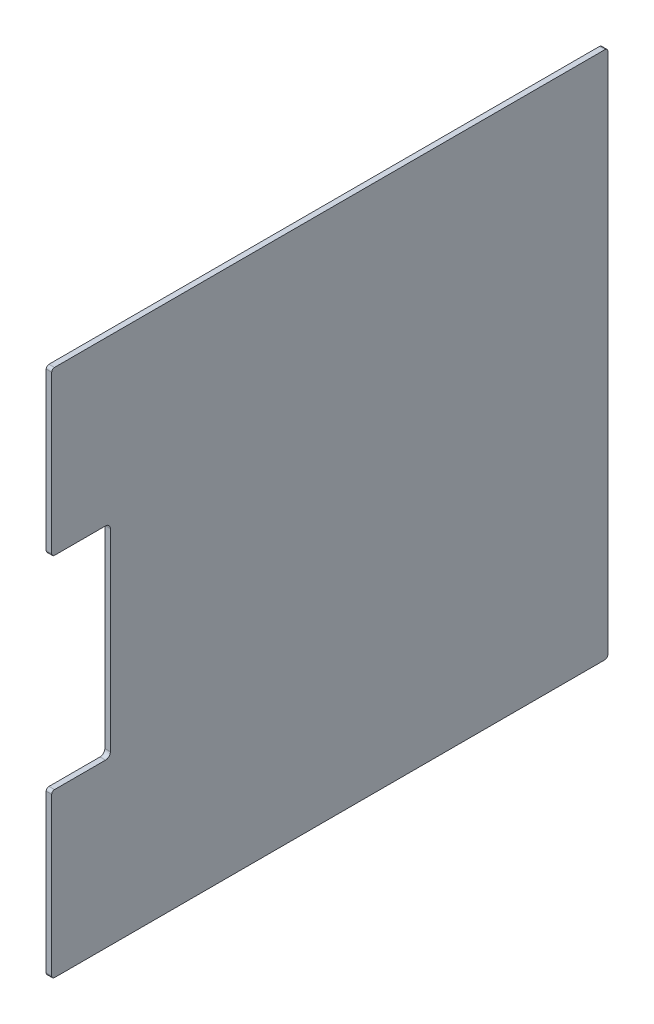
ISO-10303-21;
HEADER;
FILE_DESCRIPTION(('STEP AP214'),'2;1');
FILE_NAME('part.step','',(''),(''),'','','');
FILE_SCHEMA(('AUTOMOTIVE_DESIGN { 1 0 10303 214 1 1 1 1 }'));
ENDSEC;
DATA;
#1=APPLICATION_CONTEXT('core data for automotive mechanical design processes');
#2=APPLICATION_PROTOCOL_DEFINITION('international standard','automotive_design',2000,#1);
#3=PRODUCT_CONTEXT('',#1,'mechanical');
#4=PRODUCT('Part','Part','',(#3));
#5=PRODUCT_RELATED_PRODUCT_CATEGORY('part','',(#4));
#6=PRODUCT_DEFINITION_FORMATION('','',#4);
#7=PRODUCT_DEFINITION_CONTEXT('part definition',#1,'design');
#8=PRODUCT_DEFINITION('design','',#6,#7);
#9=PRODUCT_DEFINITION_SHAPE('','',#8);
#10=(LENGTH_UNIT() NAMED_UNIT(*) SI_UNIT(.MILLI.,.METRE.));
#11=(NAMED_UNIT(*) PLANE_ANGLE_UNIT() SI_UNIT($,.RADIAN.));
#12=(NAMED_UNIT(*) SI_UNIT($,.STERADIAN.) SOLID_ANGLE_UNIT());
#13=UNCERTAINTY_MEASURE_WITH_UNIT(LENGTH_MEASURE(1.E-05),#10,'distance_accuracy_value','');
#14=(GEOMETRIC_REPRESENTATION_CONTEXT(3) GLOBAL_UNCERTAINTY_ASSIGNED_CONTEXT((#13)) GLOBAL_UNIT_ASSIGNED_CONTEXT((#10,
#11,#12)) REPRESENTATION_CONTEXT('',''));
#15=CARTESIAN_POINT('',(0.,0.,0.));
#16=DIRECTION('',(0.,0.,1.));
#17=DIRECTION('',(1.,0.,0.));
#18=AXIS2_PLACEMENT_3D('',#15,#16,#17);
#19=CARTESIAN_POINT('',(-26.4931809643744,-352.522614019876,-39.4999994337558));
#20=DIRECTION('',(1.,0.,0.));
#21=DIRECTION('',(0.,0.,-1.));
#22=AXIS2_PLACEMENT_3D('',#19,#20,#21);
#23=CYLINDRICAL_SURFACE('',#22,2.);
#24=CARTESIAN_POINT('',(-22.493180964375,-352.522614019876,-39.4999994337558));
#25=DIRECTION('',(1.,0.,0.));
#26=DIRECTION('',(0.,0.,-1.));
#27=AXIS2_PLACEMENT_3D('',#24,#25,#26);
#28=CIRCLE('',#27,2.);
#29=CARTESIAN_POINT('',(-22.493180964375,-354.522614019876,-39.4999994337558));
#30=VERTEX_POINT('',#29);
#31=CARTESIAN_POINT('',(-22.493180964375,-352.522614019876,-41.4999994337558));
#32=VERTEX_POINT('',#31);
#33=EDGE_CURVE('E180',#30,#32,#28,.T.);
#34=ORIENTED_EDGE('',*,*,#33,.F.);
#35=DIRECTION('',(1.,0.,0.));
#36=VECTOR('',#35,1.);
#37=CARTESIAN_POINT('',(-26.4931809643744,-354.522614019876,-39.4999994337558));
#38=LINE('',#37,#36);
#39=CARTESIAN_POINT('',(-26.4931809643744,-354.522614019876,-39.4999994337558));
#40=VERTEX_POINT('',#39);
#41=EDGE_CURVE('E11',#40,#30,#38,.T.);
#42=ORIENTED_EDGE('',*,*,#41,.F.);
#43=CARTESIAN_POINT('',(-26.4931809643744,-352.522614019876,-39.4999994337558));
#44=DIRECTION('',(1.,0.,0.));
#45=DIRECTION('',(0.,0.,-1.));
#46=AXIS2_PLACEMENT_3D('',#43,#44,#45);
#47=CIRCLE('',#46,2.);
#48=CARTESIAN_POINT('',(-26.4931809643744,-352.522614019876,-41.4999994337558));
#49=VERTEX_POINT('',#48);
#50=EDGE_CURVE('E224',#40,#49,#47,.T.);
#51=ORIENTED_EDGE('',*,*,#50,.T.);
#52=DIRECTION('',(1.,0.,0.));
#53=VECTOR('',#52,1.);
#54=CARTESIAN_POINT('',(-26.4931809643744,-352.522614019876,-41.4999994337558));
#55=LINE('',#54,#53);
#56=EDGE_CURVE('E38',#49,#32,#55,.T.);
#57=ORIENTED_EDGE('',*,*,#56,.T.);
#58=EDGE_LOOP('',(#34,#42,#51,#57));
#59=FACE_BOUND('',#58,.T.);
#60=ADVANCED_FACE('F35',(#59),#23,.T.);
#61=CARTESIAN_POINT('',(-26.4931809643744,-354.522614019876,359.500000476835));
#62=DIRECTION('',(0.,-1.,0.));
#63=DIRECTION('',(0.,0.,-1.));
#64=AXIS2_PLACEMENT_3D('',#61,#62,#63);
#65=PLANE('',#64);
#66=DIRECTION('',(0.,0.,-1.));
#67=VECTOR('',#66,1.);
#68=CARTESIAN_POINT('',(-22.493180964375,-354.522614019876,359.500000476835));
#69=LINE('',#68,#67);
#70=CARTESIAN_POINT('',(-22.493180964375,-354.522614019876,359.500000476835));
#71=VERTEX_POINT('',#70);
#72=EDGE_CURVE('E222',#71,#30,#69,.T.);
#73=ORIENTED_EDGE('',*,*,#72,.F.);
#74=DIRECTION('',(1.,0.,0.));
#75=VECTOR('',#74,1.);
#76=CARTESIAN_POINT('',(-26.4931809643744,-354.522614019876,359.500000476835));
#77=LINE('',#76,#75);
#78=CARTESIAN_POINT('',(-26.4931809643744,-354.522614019876,359.500000476835));
#79=VERTEX_POINT('',#78);
#80=EDGE_CURVE('E44',#79,#71,#77,.T.);
#81=ORIENTED_EDGE('',*,*,#80,.F.);
#82=DIRECTION('',(0.,0.,-1.));
#83=VECTOR('',#82,1.);
#84=CARTESIAN_POINT('',(-26.4931809643744,-354.522614019876,359.500000476835));
#85=LINE('',#84,#83);
#86=EDGE_CURVE('E170',#79,#40,#85,.T.);
#87=ORIENTED_EDGE('',*,*,#86,.T.);
#88=ORIENTED_EDGE('',*,*,#41,.T.);
#89=EDGE_LOOP('',(#73,#81,#87,#88));
#90=FACE_BOUND('',#89,.T.);
#91=ADVANCED_FACE('F252',(#90),#65,.T.);
#92=CARTESIAN_POINT('',(-26.4931809643744,-352.522614019876,359.500000476835));
#93=DIRECTION('',(1.,0.,0.));
#94=DIRECTION('',(0.,0.,-1.));
#95=AXIS2_PLACEMENT_3D('',#92,#93,#94);
#96=CYLINDRICAL_SURFACE('',#95,2.);
#97=CARTESIAN_POINT('',(-22.493180964375,-352.522614019876,359.500000476835));
#98=DIRECTION('',(1.,0.,0.));
#99=DIRECTION('',(0.,0.,-1.));
#100=AXIS2_PLACEMENT_3D('',#97,#98,#99);
#101=CIRCLE('',#100,2.);
#102=CARTESIAN_POINT('',(-22.493180964375,-352.522614019876,361.500000476835));
#103=VERTEX_POINT('',#102);
#104=EDGE_CURVE('E157',#103,#71,#101,.T.);
#105=ORIENTED_EDGE('',*,*,#104,.F.);
#106=DIRECTION('',(1.,0.,0.));
#107=VECTOR('',#106,1.);
#108=CARTESIAN_POINT('',(-26.4931809643744,-352.522614019876,361.500000476835));
#109=LINE('',#108,#107);
#110=CARTESIAN_POINT('',(-26.4931809643744,-352.522614019876,361.500000476835));
#111=VERTEX_POINT('',#110);
#112=EDGE_CURVE('E152',#111,#103,#109,.T.);
#113=ORIENTED_EDGE('',*,*,#112,.F.);
#114=CARTESIAN_POINT('',(-26.4931809643744,-352.522614019876,359.500000476835));
#115=DIRECTION('',(1.,0.,0.));
#116=DIRECTION('',(0.,0.,-1.));
#117=AXIS2_PLACEMENT_3D('',#114,#115,#116);
#118=CIRCLE('',#117,2.);
#119=EDGE_CURVE('E155',#111,#79,#118,.T.);
#120=ORIENTED_EDGE('',*,*,#119,.T.);
#121=ORIENTED_EDGE('',*,*,#80,.T.);
#122=EDGE_LOOP('',(#105,#113,#120,#121));
#123=FACE_BOUND('',#122,.T.);
#124=ADVANCED_FACE('F154',(#123),#96,.T.);
#125=CARTESIAN_POINT('',(-26.4931809643744,-238.499667693611,361.500000476835));
#126=DIRECTION('',(0.,0.,1.));
#127=DIRECTION('',(1.,0.,0.));
#128=AXIS2_PLACEMENT_3D('',#125,#126,#127);
#129=PLANE('',#128);
#130=DIRECTION('',(0.,-1.,0.));
#131=VECTOR('',#130,1.);
#132=CARTESIAN_POINT('',(-22.493180964375,-238.499667693611,361.500000476835));
#133=LINE('',#132,#131);
#134=CARTESIAN_POINT('',(-22.493180964375,-238.499667693611,361.500000476835));
#135=VERTEX_POINT('',#134);
#136=EDGE_CURVE('E219',#135,#103,#133,.T.);
#137=ORIENTED_EDGE('',*,*,#136,.F.);
#138=DIRECTION('',(1.,0.,0.));
#139=VECTOR('',#138,1.);
#140=CARTESIAN_POINT('',(-26.4931809643744,-238.499667693611,361.500000476835));
#141=LINE('',#140,#139);
#142=CARTESIAN_POINT('',(-26.4931809643744,-238.499667693611,361.500000476835));
#143=VERTEX_POINT('',#142);
#144=EDGE_CURVE('E162',#143,#135,#141,.T.);
#145=ORIENTED_EDGE('',*,*,#144,.F.);
#146=DIRECTION('',(0.,-1.,0.));
#147=VECTOR('',#146,1.);
#148=CARTESIAN_POINT('',(-26.4931809643744,-238.499667693611,361.500000476835));
#149=LINE('',#148,#147);
#150=EDGE_CURVE('E168',#143,#111,#149,.T.);
#151=ORIENTED_EDGE('',*,*,#150,.T.);
#152=ORIENTED_EDGE('',*,*,#112,.T.);
#153=EDGE_LOOP('',(#137,#145,#151,#152));
#154=FACE_BOUND('',#153,.T.);
#155=ADVANCED_FACE('F172',(#154),#129,.T.);
#156=CARTESIAN_POINT('',(-26.4931809643744,-238.499667693611,359.500000476835));
#157=DIRECTION('',(1.,0.,0.));
#158=DIRECTION('',(0.,0.,-1.));
#159=AXIS2_PLACEMENT_3D('',#156,#157,#158);
#160=CYLINDRICAL_SURFACE('',#159,2.);
#161=CARTESIAN_POINT('',(-22.493180964375,-238.499667693611,359.500000476835));
#162=DIRECTION('',(1.,0.,0.));
#163=DIRECTION('',(0.,0.,-1.));
#164=AXIS2_PLACEMENT_3D('',#161,#162,#163);
#165=CIRCLE('',#164,2.);
#166=CARTESIAN_POINT('',(-22.493180964375,-236.499667693611,359.500000476835));
#167=VERTEX_POINT('',#166);
#168=EDGE_CURVE('E216',#167,#135,#165,.T.);
#169=ORIENTED_EDGE('',*,*,#168,.F.);
#170=DIRECTION('',(1.,0.,0.));
#171=VECTOR('',#170,1.);
#172=CARTESIAN_POINT('',(-26.4931809643744,-236.499667693611,359.500000476835));
#173=LINE('',#172,#171);
#174=CARTESIAN_POINT('',(-26.4931809643744,-236.499667693611,359.500000476835));
#175=VERTEX_POINT('',#174);
#176=EDGE_CURVE('E228',#175,#167,#173,.T.);
#177=ORIENTED_EDGE('',*,*,#176,.F.);
#178=CARTESIAN_POINT('',(-26.4931809643744,-238.499667693611,359.500000476835));
#179=DIRECTION('',(1.,0.,0.));
#180=DIRECTION('',(0.,0.,-1.));
#181=AXIS2_PLACEMENT_3D('',#178,#179,#180);
#182=CIRCLE('',#181,2.);
#183=EDGE_CURVE('E173',#175,#143,#182,.T.);
#184=ORIENTED_EDGE('',*,*,#183,.T.);
#185=ORIENTED_EDGE('',*,*,#144,.T.);
#186=EDGE_LOOP('',(#169,#177,#184,#185));
#187=FACE_BOUND('',#186,.T.);
#188=ADVANCED_FACE('F265',(#187),#160,.T.);
#189=CARTESIAN_POINT('',(-26.4931809643744,-236.499667693611,322.5));
#190=DIRECTION('',(0.,1.,0.));
#191=DIRECTION('',(0.,0.,1.));
#192=AXIS2_PLACEMENT_3D('',#189,#190,#191);
#193=PLANE('',#192);
#194=DIRECTION('',(0.,0.,1.));
#195=VECTOR('',#194,1.);
#196=CARTESIAN_POINT('',(-22.493180964375,-236.499667693611,322.5));
#197=LINE('',#196,#195);
#198=CARTESIAN_POINT('',(-22.493180964375,-236.499667693611,322.5));
#199=VERTEX_POINT('',#198);
#200=EDGE_CURVE('E213',#199,#167,#197,.T.);
#201=ORIENTED_EDGE('',*,*,#200,.F.);
#202=DIRECTION('',(1.,0.,0.));
#203=VECTOR('',#202,1.);
#204=CARTESIAN_POINT('',(-26.4931809643744,-236.499667693611,322.5));
#205=LINE('',#204,#203);
#206=CARTESIAN_POINT('',(-26.4931809643744,-236.499667693611,322.5));
#207=VERTEX_POINT('',#206);
#208=EDGE_CURVE('E230',#207,#199,#205,.T.);
#209=ORIENTED_EDGE('',*,*,#208,.F.);
#210=DIRECTION('',(0.,0.,1.));
#211=VECTOR('',#210,1.);
#212=CARTESIAN_POINT('',(-26.4931809643744,-236.499667693611,322.5));
#213=LINE('',#212,#211);
#214=EDGE_CURVE('E175',#207,#175,#213,.T.);
#215=ORIENTED_EDGE('',*,*,#214,.T.);
#216=ORIENTED_EDGE('',*,*,#176,.T.);
#217=EDGE_LOOP('',(#201,#209,#215,#216));
#218=FACE_BOUND('',#217,.T.);
#219=ADVANCED_FACE('F268',(#218),#193,.T.);
#220=CARTESIAN_POINT('',(-26.4931809643744,-232.999667693611,322.5));
#221=DIRECTION('',(1.,0.,0.));
#222=DIRECTION('',(0.,0.,-1.));
#223=AXIS2_PLACEMENT_3D('',#220,#221,#222);
#224=CYLINDRICAL_SURFACE('',#223,3.49999999999999);
#225=CARTESIAN_POINT('',(-22.493180964375,-232.999667693611,322.5));
#226=DIRECTION('',(-1.,0.,0.));
#227=DIRECTION('',(0.,0.,1.));
#228=AXIS2_PLACEMENT_3D('',#225,#226,#227);
#229=CIRCLE('',#228,3.49999999999999);
#230=CARTESIAN_POINT('',(-22.493180964375,-232.999667693611,319.));
#231=VERTEX_POINT('',#230);
#232=EDGE_CURVE('E210',#231,#199,#229,.T.);
#233=ORIENTED_EDGE('',*,*,#232,.F.);
#234=DIRECTION('',(1.,0.,0.));
#235=VECTOR('',#234,1.);
#236=CARTESIAN_POINT('',(-26.4931809643744,-232.999667693611,319.));
#237=LINE('',#236,#235);
#238=CARTESIAN_POINT('',(-26.4931809643744,-232.999667693611,319.));
#239=VERTEX_POINT('',#238);
#240=EDGE_CURVE('E232',#239,#231,#237,.T.);
#241=ORIENTED_EDGE('',*,*,#240,.F.);
#242=CARTESIAN_POINT('',(-26.4931809643744,-232.999667693611,322.5));
#243=DIRECTION('',(-1.,0.,0.));
#244=DIRECTION('',(0.,0.,1.));
#245=AXIS2_PLACEMENT_3D('',#242,#243,#244);
#246=CIRCLE('',#245,3.49999999999999);
#247=EDGE_CURVE('E449',#239,#207,#246,.T.);
#248=ORIENTED_EDGE('',*,*,#247,.T.);
#249=ORIENTED_EDGE('',*,*,#208,.T.);
#250=EDGE_LOOP('',(#233,#241,#248,#249));
#251=FACE_BOUND('',#250,.T.);
#252=ADVANCED_FACE('F272',(#251),#224,.F.);
#253=CARTESIAN_POINT('',(-26.4931809643744,-92.9996676936113,319.));
#254=DIRECTION('',(0.,0.,1.));
#255=DIRECTION('',(0.,-1.,0.));
#256=AXIS2_PLACEMENT_3D('',#253,#254,#255);
#257=PLANE('',#256);
#258=DIRECTION('',(0.,-1.,0.));
#259=VECTOR('',#258,1.);
#260=CARTESIAN_POINT('',(-22.493180964375,-92.9996676936113,319.));
#261=LINE('',#260,#259);
#262=CARTESIAN_POINT('',(-22.493180964375,-92.9996676936113,319.));
#263=VERTEX_POINT('',#262);
#264=EDGE_CURVE('E207',#263,#231,#261,.T.);
#265=ORIENTED_EDGE('',*,*,#264,.F.);
#266=DIRECTION('',(1.,0.,0.));
#267=VECTOR('',#266,1.);
#268=CARTESIAN_POINT('',(-26.4931809643744,-92.9996676936113,319.));
#269=LINE('',#268,#267);
#270=CARTESIAN_POINT('',(-26.4931809643744,-92.9996676936113,319.));
#271=VERTEX_POINT('',#270);
#272=EDGE_CURVE('E234',#271,#263,#269,.T.);
#273=ORIENTED_EDGE('',*,*,#272,.F.);
#274=DIRECTION('',(0.,-1.,0.));
#275=VECTOR('',#274,1.);
#276=CARTESIAN_POINT('',(-26.4931809643744,-92.9996676936113,319.));
#277=LINE('',#276,#275);
#278=EDGE_CURVE('E445',#271,#239,#277,.T.);
#279=ORIENTED_EDGE('',*,*,#278,.T.);
#280=ORIENTED_EDGE('',*,*,#240,.T.);
#281=EDGE_LOOP('',(#265,#273,#279,#280));
#282=FACE_BOUND('',#281,.T.);
#283=ADVANCED_FACE('F276',(#282),#257,.T.);
#284=CARTESIAN_POINT('',(-26.4931809643744,-92.9996676936113,322.5));
#285=DIRECTION('',(1.,0.,0.));
#286=DIRECTION('',(0.,0.,-1.));
#287=AXIS2_PLACEMENT_3D('',#284,#285,#286);
#288=CYLINDRICAL_SURFACE('',#287,3.5);
#289=CARTESIAN_POINT('',(-22.493180964375,-92.9996676936113,322.5));
#290=DIRECTION('',(-1.,0.,0.));
#291=DIRECTION('',(0.,0.,1.));
#292=AXIS2_PLACEMENT_3D('',#289,#290,#291);
#293=CIRCLE('',#292,3.5);
#294=CARTESIAN_POINT('',(-22.493180964375,-89.4996676936113,322.5));
#295=VERTEX_POINT('',#294);
#296=EDGE_CURVE('E204',#295,#263,#293,.T.);
#297=ORIENTED_EDGE('',*,*,#296,.F.);
#298=DIRECTION('',(1.,0.,0.));
#299=VECTOR('',#298,1.);
#300=CARTESIAN_POINT('',(-26.4931809643744,-89.4996676936113,322.5));
#301=LINE('',#300,#299);
#302=CARTESIAN_POINT('',(-26.4931809643744,-89.4996676936113,322.5));
#303=VERTEX_POINT('',#302);
#304=EDGE_CURVE('E236',#303,#295,#301,.T.);
#305=ORIENTED_EDGE('',*,*,#304,.F.);
#306=CARTESIAN_POINT('',(-26.4931809643744,-92.9996676936113,322.5));
#307=DIRECTION('',(-1.,0.,0.));
#308=DIRECTION('',(0.,0.,1.));
#309=AXIS2_PLACEMENT_3D('',#306,#307,#308);
#310=CIRCLE('',#309,3.5);
#311=EDGE_CURVE('E456',#303,#271,#310,.T.);
#312=ORIENTED_EDGE('',*,*,#311,.T.);
#313=ORIENTED_EDGE('',*,*,#272,.T.);
#314=EDGE_LOOP('',(#297,#305,#312,#313));
#315=FACE_BOUND('',#314,.T.);
#316=ADVANCED_FACE('F280',(#315),#288,.F.);
#317=CARTESIAN_POINT('',(-26.4931809643744,-89.4996676936113,359.500000476835));
#318=DIRECTION('',(0.,-1.,0.));
#319=DIRECTION('',(0.,0.,-1.));
#320=AXIS2_PLACEMENT_3D('',#317,#318,#319);
#321=PLANE('',#320);
#322=DIRECTION('',(0.,0.,-1.));
#323=VECTOR('',#322,1.);
#324=CARTESIAN_POINT('',(-22.493180964375,-89.4996676936113,359.500000476835));
#325=LINE('',#324,#323);
#326=CARTESIAN_POINT('',(-22.493180964375,-89.4996676936113,359.500000476835));
#327=VERTEX_POINT('',#326);
#328=EDGE_CURVE('E201',#327,#295,#325,.T.);
#329=ORIENTED_EDGE('',*,*,#328,.F.);
#330=DIRECTION('',(1.,0.,0.));
#331=VECTOR('',#330,1.);
#332=CARTESIAN_POINT('',(-26.4931809643744,-89.4996676936113,359.500000476835));
#333=LINE('',#332,#331);
#334=CARTESIAN_POINT('',(-26.4931809643744,-89.4996676936113,359.500000476835));
#335=VERTEX_POINT('',#334);
#336=EDGE_CURVE('E238',#335,#327,#333,.T.);
#337=ORIENTED_EDGE('',*,*,#336,.F.);
#338=DIRECTION('',(0.,0.,-1.));
#339=VECTOR('',#338,1.);
#340=CARTESIAN_POINT('',(-26.4931809643744,-89.4996676936113,359.500000476835));
#341=LINE('',#340,#339);
#342=EDGE_CURVE('E438',#335,#303,#341,.T.);
#343=ORIENTED_EDGE('',*,*,#342,.T.);
#344=ORIENTED_EDGE('',*,*,#304,.T.);
#345=EDGE_LOOP('',(#329,#337,#343,#344));
#346=FACE_BOUND('',#345,.T.);
#347=ADVANCED_FACE('F284',(#346),#321,.T.);
#348=CARTESIAN_POINT('',(-26.4931809643744,-87.4996676936113,359.500000476835));
#349=DIRECTION('',(1.,0.,0.));
#350=DIRECTION('',(0.,0.,-1.));
#351=AXIS2_PLACEMENT_3D('',#348,#349,#350);
#352=CYLINDRICAL_SURFACE('',#351,2.00000000000001);
#353=CARTESIAN_POINT('',(-22.493180964375,-87.4996676936113,359.500000476835));
#354=DIRECTION('',(1.,0.,0.));
#355=DIRECTION('',(0.,0.,-1.));
#356=AXIS2_PLACEMENT_3D('',#353,#354,#355);
#357=CIRCLE('',#356,2.00000000000001);
#358=CARTESIAN_POINT('',(-22.493180964375,-87.4996676936113,361.500000476835));
#359=VERTEX_POINT('',#358);
#360=EDGE_CURVE('E198',#359,#327,#357,.T.);
#361=ORIENTED_EDGE('',*,*,#360,.F.);
#362=DIRECTION('',(1.,0.,0.));
#363=VECTOR('',#362,1.);
#364=CARTESIAN_POINT('',(-26.4931809643744,-87.4996676936113,361.500000476835));
#365=LINE('',#364,#363);
#366=CARTESIAN_POINT('',(-26.4931809643744,-87.4996676936113,361.500000476835));
#367=VERTEX_POINT('',#366);
#368=EDGE_CURVE('E240',#367,#359,#365,.T.);
#369=ORIENTED_EDGE('',*,*,#368,.F.);
#370=CARTESIAN_POINT('',(-26.4931809643744,-87.4996676936113,359.500000476835));
#371=DIRECTION('',(1.,0.,0.));
#372=DIRECTION('',(0.,0.,-1.));
#373=AXIS2_PLACEMENT_3D('',#370,#371,#372);
#374=CIRCLE('',#373,2.00000000000001);
#375=EDGE_CURVE('E434',#367,#335,#374,.T.);
#376=ORIENTED_EDGE('',*,*,#375,.T.);
#377=ORIENTED_EDGE('',*,*,#336,.T.);
#378=EDGE_LOOP('',(#361,#369,#376,#377));
#379=FACE_BOUND('',#378,.T.);
#380=ADVANCED_FACE('F288',(#379),#352,.T.);
#381=CARTESIAN_POINT('',(-26.4931809643744,26.4773858907143,361.500000476835));
#382=DIRECTION('',(0.,0.,1.));
#383=DIRECTION('',(1.,0.,0.));
#384=AXIS2_PLACEMENT_3D('',#381,#382,#383);
#385=PLANE('',#384);
#386=DIRECTION('',(0.,-1.,0.));
#387=VECTOR('',#386,1.);
#388=CARTESIAN_POINT('',(-22.493180964375,26.4773858907143,361.500000476835));
#389=LINE('',#388,#387);
#390=CARTESIAN_POINT('',(-22.493180964375,26.4773858907143,361.500000476835));
#391=VERTEX_POINT('',#390);
#392=EDGE_CURVE('E195',#391,#359,#389,.T.);
#393=ORIENTED_EDGE('',*,*,#392,.F.);
#394=DIRECTION('',(1.,0.,0.));
#395=VECTOR('',#394,1.);
#396=CARTESIAN_POINT('',(-26.4931809643744,26.4773858907143,361.500000476835));
#397=LINE('',#396,#395);
#398=CARTESIAN_POINT('',(-26.4931809643744,26.4773858907143,361.500000476835));
#399=VERTEX_POINT('',#398);
#400=EDGE_CURVE('E242',#399,#391,#397,.T.);
#401=ORIENTED_EDGE('',*,*,#400,.F.);
#402=DIRECTION('',(0.,-1.,0.));
#403=VECTOR('',#402,1.);
#404=CARTESIAN_POINT('',(-26.4931809643744,26.4773858907143,361.500000476835));
#405=LINE('',#404,#403);
#406=EDGE_CURVE('E460',#399,#367,#405,.T.);
#407=ORIENTED_EDGE('',*,*,#406,.T.);
#408=ORIENTED_EDGE('',*,*,#368,.T.);
#409=EDGE_LOOP('',(#393,#401,#407,#408));
#410=FACE_BOUND('',#409,.T.);
#411=ADVANCED_FACE('F292',(#410),#385,.T.);
#412=CARTESIAN_POINT('',(-26.4931809643744,26.4773858907143,359.500000476835));
#413=DIRECTION('',(1.,0.,0.));
#414=DIRECTION('',(0.,0.,-1.));
#415=AXIS2_PLACEMENT_3D('',#412,#413,#414);
#416=CYLINDRICAL_SURFACE('',#415,2.);
#417=CARTESIAN_POINT('',(-22.493180964375,26.4773858907143,359.500000476835));
#418=DIRECTION('',(1.,0.,0.));
#419=DIRECTION('',(0.,0.,-1.));
#420=AXIS2_PLACEMENT_3D('',#417,#418,#419);
#421=CIRCLE('',#420,2.);
#422=CARTESIAN_POINT('',(-22.493180964375,28.4773858907143,359.500000476835));
#423=VERTEX_POINT('',#422);
#424=EDGE_CURVE('E192',#423,#391,#421,.T.);
#425=ORIENTED_EDGE('',*,*,#424,.F.);
#426=DIRECTION('',(1.,0.,0.));
#427=VECTOR('',#426,1.);
#428=CARTESIAN_POINT('',(-26.4931809643744,28.4773858907143,359.500000476835));
#429=LINE('',#428,#427);
#430=CARTESIAN_POINT('',(-26.4931809643744,28.4773858907143,359.500000476835));
#431=VERTEX_POINT('',#430);
#432=EDGE_CURVE('E244',#431,#423,#429,.T.);
#433=ORIENTED_EDGE('',*,*,#432,.F.);
#434=CARTESIAN_POINT('',(-26.4931809643744,26.4773858907143,359.500000476835));
#435=DIRECTION('',(1.,0.,0.));
#436=DIRECTION('',(0.,0.,-1.));
#437=AXIS2_PLACEMENT_3D('',#434,#435,#436);
#438=CIRCLE('',#437,2.);
#439=EDGE_CURVE('E427',#431,#399,#438,.T.);
#440=ORIENTED_EDGE('',*,*,#439,.T.);
#441=ORIENTED_EDGE('',*,*,#400,.T.);
#442=EDGE_LOOP('',(#425,#433,#440,#441));
#443=FACE_BOUND('',#442,.T.);
#444=ADVANCED_FACE('F296',(#443),#416,.T.);
#445=CARTESIAN_POINT('',(-26.4931809643744,28.4773858907143,-39.4999994337558));
#446=DIRECTION('',(0.,1.,0.));
#447=DIRECTION('',(0.,0.,1.));
#448=AXIS2_PLACEMENT_3D('',#445,#446,#447);
#449=PLANE('',#448);
#450=DIRECTION('',(0.,0.,1.));
#451=VECTOR('',#450,1.);
#452=CARTESIAN_POINT('',(-22.493180964375,28.4773858907143,-39.4999994337558));
#453=LINE('',#452,#451);
#454=CARTESIAN_POINT('',(-22.493180964375,28.4773858907143,-39.4999994337558));
#455=VERTEX_POINT('',#454);
#456=EDGE_CURVE('E189',#455,#423,#453,.T.);
#457=ORIENTED_EDGE('',*,*,#456,.F.);
#458=DIRECTION('',(1.,0.,0.));
#459=VECTOR('',#458,1.);
#460=CARTESIAN_POINT('',(-26.4931809643744,28.4773858907143,-39.4999994337558));
#461=LINE('',#460,#459);
#462=CARTESIAN_POINT('',(-26.4931809643744,28.4773858907143,-39.4999994337558));
#463=VERTEX_POINT('',#462);
#464=EDGE_CURVE('E246',#463,#455,#461,.T.);
#465=ORIENTED_EDGE('',*,*,#464,.F.);
#466=DIRECTION('',(0.,0.,1.));
#467=VECTOR('',#466,1.);
#468=CARTESIAN_POINT('',(-26.4931809643744,28.4773858907143,-39.4999994337558));
#469=LINE('',#468,#467);
#470=EDGE_CURVE('E423',#463,#431,#469,.T.);
#471=ORIENTED_EDGE('',*,*,#470,.T.);
#472=ORIENTED_EDGE('',*,*,#432,.T.);
#473=EDGE_LOOP('',(#457,#465,#471,#472));
#474=FACE_BOUND('',#473,.T.);
#475=ADVANCED_FACE('F300',(#474),#449,.T.);
#476=CARTESIAN_POINT('',(-26.4931809643744,26.4773858907143,-39.4999994337558));
#477=DIRECTION('',(1.,0.,0.));
#478=DIRECTION('',(0.,0.,-1.));
#479=AXIS2_PLACEMENT_3D('',#476,#477,#478);
#480=CYLINDRICAL_SURFACE('',#479,1.99999999999999);
#481=CARTESIAN_POINT('',(-22.493180964375,26.4773858907143,-39.4999994337558));
#482=DIRECTION('',(1.,0.,0.));
#483=DIRECTION('',(0.,0.,-1.));
#484=AXIS2_PLACEMENT_3D('',#481,#482,#483);
#485=CIRCLE('',#484,1.99999999999999);
#486=CARTESIAN_POINT('',(-22.493180964375,26.4773858907143,-41.4999994337558));
#487=VERTEX_POINT('',#486);
#488=EDGE_CURVE('E186',#487,#455,#485,.T.);
#489=ORIENTED_EDGE('',*,*,#488,.F.);
#490=DIRECTION('',(1.,0.,0.));
#491=VECTOR('',#490,1.);
#492=CARTESIAN_POINT('',(-26.4931809643744,26.4773858907143,-41.4999994337558));
#493=LINE('',#492,#491);
#494=CARTESIAN_POINT('',(-26.4931809643744,26.4773858907143,-41.4999994337558));
#495=VERTEX_POINT('',#494);
#496=EDGE_CURVE('E247',#495,#487,#493,.T.);
#497=ORIENTED_EDGE('',*,*,#496,.F.);
#498=CARTESIAN_POINT('',(-26.4931809643744,26.4773858907143,-39.4999994337558));
#499=DIRECTION('',(1.,0.,0.));
#500=DIRECTION('',(0.,0.,-1.));
#501=AXIS2_PLACEMENT_3D('',#498,#499,#500);
#502=CIRCLE('',#501,1.99999999999999);
#503=EDGE_CURVE('E464',#495,#463,#502,.T.);
#504=ORIENTED_EDGE('',*,*,#503,.T.);
#505=ORIENTED_EDGE('',*,*,#464,.T.);
#506=EDGE_LOOP('',(#489,#497,#504,#505));
#507=FACE_BOUND('',#506,.T.);
#508=ADVANCED_FACE('F304',(#507),#480,.T.);
#509=CARTESIAN_POINT('',(-26.4931809643744,-352.522614019876,-41.4999994337558));
#510=DIRECTION('',(0.,0.,-1.));
#511=DIRECTION('',(-1.,0.,0.));
#512=AXIS2_PLACEMENT_3D('',#509,#510,#511);
#513=PLANE('',#512);
#514=DIRECTION('',(0.,1.,0.));
#515=VECTOR('',#514,1.);
#516=CARTESIAN_POINT('',(-22.493180964375,-352.522614019876,-41.4999994337558));
#517=LINE('',#516,#515);
#518=EDGE_CURVE('E183',#32,#487,#517,.T.);
#519=ORIENTED_EDGE('',*,*,#518,.F.);
#520=ORIENTED_EDGE('',*,*,#56,.F.);
#521=DIRECTION('',(0.,1.,0.));
#522=VECTOR('',#521,1.);
#523=CARTESIAN_POINT('',(-26.4931809643744,-352.522614019876,-41.4999994337558));
#524=LINE('',#523,#522);
#525=EDGE_CURVE('E466',#49,#495,#524,.T.);
#526=ORIENTED_EDGE('',*,*,#525,.T.);
#527=ORIENTED_EDGE('',*,*,#496,.T.);
#528=EDGE_LOOP('',(#519,#520,#526,#527));
#529=FACE_BOUND('',#528,.T.);
#530=ADVANCED_FACE('F249',(#529),#513,.T.);
#531=CARTESIAN_POINT('',(-26.4931809643744,-352.522614019876,-39.4999994337558));
#532=DIRECTION('',(1.,0.,0.));
#533=DIRECTION('',(0.,0.,-1.));
#534=AXIS2_PLACEMENT_3D('',#531,#532,#533);
#535=PLANE('',#534);
#536=ORIENTED_EDGE('',*,*,#50,.F.);
#537=ORIENTED_EDGE('',*,*,#86,.F.);
#538=ORIENTED_EDGE('',*,*,#119,.F.);
#539=ORIENTED_EDGE('',*,*,#150,.F.);
#540=ORIENTED_EDGE('',*,*,#183,.F.);
#541=ORIENTED_EDGE('',*,*,#214,.F.);
#542=ORIENTED_EDGE('',*,*,#247,.F.);
#543=ORIENTED_EDGE('',*,*,#278,.F.);
#544=ORIENTED_EDGE('',*,*,#311,.F.);
#545=ORIENTED_EDGE('',*,*,#342,.F.);
#546=ORIENTED_EDGE('',*,*,#375,.F.);
#547=ORIENTED_EDGE('',*,*,#406,.F.);
#548=ORIENTED_EDGE('',*,*,#439,.F.);
#549=ORIENTED_EDGE('',*,*,#470,.F.);
#550=ORIENTED_EDGE('',*,*,#503,.F.);
#551=ORIENTED_EDGE('',*,*,#525,.F.);
#552=EDGE_LOOP('',(#536,#537,#538,#539,#540,#541,#542,#543,#544,#545,#546,#547,#548,#549,#550,#551));
#553=FACE_BOUND('',#552,.T.);
#554=ADVANCED_FACE('F166',(#553),#535,.F.);
#555=CARTESIAN_POINT('',(-22.493180964375,-352.522614019876,-39.4999994337558));
#556=DIRECTION('',(1.,0.,0.));
#557=DIRECTION('',(0.,0.,-1.));
#558=AXIS2_PLACEMENT_3D('',#555,#556,#557);
#559=PLANE('',#558);
#560=ORIENTED_EDGE('',*,*,#33,.T.);
#561=ORIENTED_EDGE('',*,*,#518,.T.);
#562=ORIENTED_EDGE('',*,*,#488,.T.);
#563=ORIENTED_EDGE('',*,*,#456,.T.);
#564=ORIENTED_EDGE('',*,*,#424,.T.);
#565=ORIENTED_EDGE('',*,*,#392,.T.);
#566=ORIENTED_EDGE('',*,*,#360,.T.);
#567=ORIENTED_EDGE('',*,*,#328,.T.);
#568=ORIENTED_EDGE('',*,*,#296,.T.);
#569=ORIENTED_EDGE('',*,*,#264,.T.);
#570=ORIENTED_EDGE('',*,*,#232,.T.);
#571=ORIENTED_EDGE('',*,*,#200,.T.);
#572=ORIENTED_EDGE('',*,*,#168,.T.);
#573=ORIENTED_EDGE('',*,*,#136,.T.);
#574=ORIENTED_EDGE('',*,*,#104,.T.);
#575=ORIENTED_EDGE('',*,*,#72,.T.);
#576=EDGE_LOOP('',(#560,#561,#562,#563,#564,#565,#566,#567,#568,#569,#570,#571,#572,#573,#574,#575));
#577=FACE_BOUND('',#576,.T.);
#578=ADVANCED_FACE('F251',(#577),#559,.T.);
#579=CLOSED_SHELL('',(#60,#91,#124,#155,#188,#219,#252,#283,#316,#347,#380,#411,#444,#475,#508,
#530,#554,#578));
#580=MANIFOLD_SOLID_BREP('B2',#579);
#581=ADVANCED_BREP_SHAPE_REPRESENTATION('',(#18,#580),#14);
#582=SHAPE_DEFINITION_REPRESENTATION(#9,#581);
ENDSEC;
END-ISO-10303-21;
